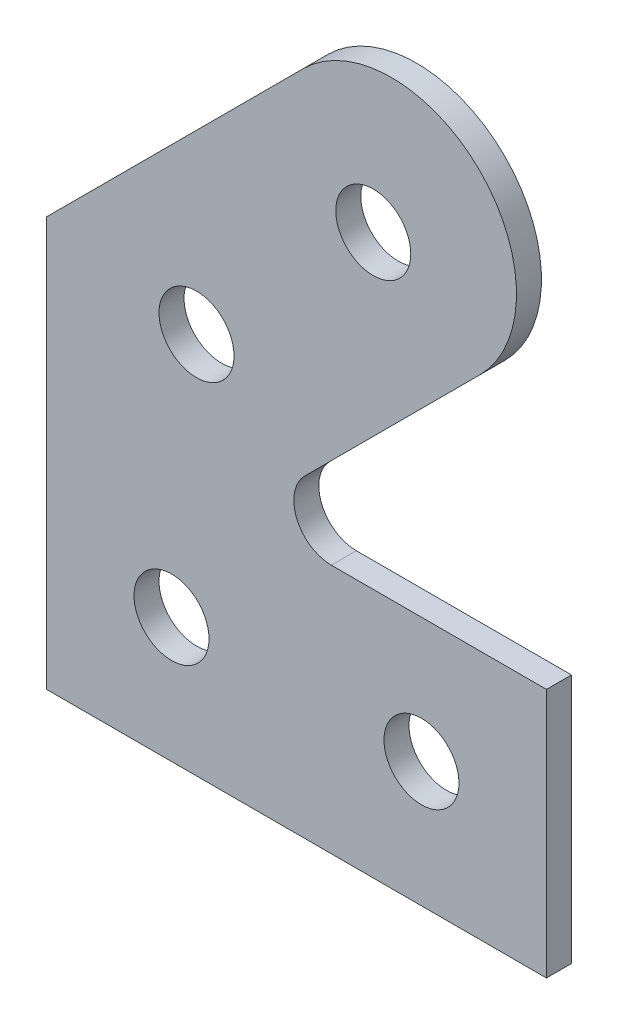
ISO-10303-21;
HEADER;
FILE_DESCRIPTION(('STEP AP214'),'2;1');
FILE_NAME('part.step','',(''),(''),'','','');
FILE_SCHEMA(('AUTOMOTIVE_DESIGN { 1 0 10303 214 1 1 1 1 }'));
ENDSEC;
DATA;
#1=APPLICATION_CONTEXT('core data for automotive mechanical design processes');
#2=APPLICATION_PROTOCOL_DEFINITION('international standard','automotive_design',2000,#1);
#3=PRODUCT_CONTEXT('',#1,'mechanical');
#4=PRODUCT('Part','Part','',(#3));
#5=PRODUCT_RELATED_PRODUCT_CATEGORY('part','',(#4));
#6=PRODUCT_DEFINITION_FORMATION('','',#4);
#7=PRODUCT_DEFINITION_CONTEXT('part definition',#1,'design');
#8=PRODUCT_DEFINITION('design','',#6,#7);
#9=PRODUCT_DEFINITION_SHAPE('','',#8);
#10=(LENGTH_UNIT() NAMED_UNIT(*) SI_UNIT(.MILLI.,.METRE.));
#11=(NAMED_UNIT(*) PLANE_ANGLE_UNIT() SI_UNIT($,.RADIAN.));
#12=(NAMED_UNIT(*) SI_UNIT($,.STERADIAN.) SOLID_ANGLE_UNIT());
#13=UNCERTAINTY_MEASURE_WITH_UNIT(LENGTH_MEASURE(1.E-05),#10,'distance_accuracy_value','');
#14=(GEOMETRIC_REPRESENTATION_CONTEXT(3) GLOBAL_UNCERTAINTY_ASSIGNED_CONTEXT((#13)) GLOBAL_UNIT_ASSIGNED_CONTEXT((#10,
#11,#12)) REPRESENTATION_CONTEXT('',''));
#15=CARTESIAN_POINT('',(0.,0.,0.));
#16=DIRECTION('',(0.,0.,1.));
#17=DIRECTION('',(1.,0.,0.));
#18=AXIS2_PLACEMENT_3D('',#15,#16,#17);
#19=CARTESIAN_POINT('',(13.8,23.1,1.));
#20=DIRECTION('',(0.,0.,-1.));
#21=DIRECTION('',(-1.,0.,0.));
#22=AXIS2_PLACEMENT_3D('',#19,#20,#21);
#23=PLANE('',#22);
#24=DIRECTION('',(0.,-1.,0.));
#25=VECTOR('',#24,1.);
#26=CARTESIAN_POINT('',(0.,0.,1.));
#27=LINE('',#26,#25);
#28=CARTESIAN_POINT('',(0.,16.3710678118655,1.));
#29=VERTEX_POINT('',#28);
#30=CARTESIAN_POINT('',(0.,0.,1.));
#31=VERTEX_POINT('',#30);
#32=EDGE_CURVE('E145',#29,#31,#27,.T.);
#33=ORIENTED_EDGE('',*,*,#32,.T.);
#34=DIRECTION('',(1.,0.,0.));
#35=VECTOR('',#34,1.);
#36=CARTESIAN_POINT('',(0.,0.,1.));
#37=LINE('',#36,#35);
#38=CARTESIAN_POINT('',(20.,0.,1.));
#39=VERTEX_POINT('',#38);
#40=EDGE_CURVE('E93',#31,#39,#37,.T.);
#41=ORIENTED_EDGE('',*,*,#40,.T.);
#42=DIRECTION('',(0.,1.,0.));
#43=VECTOR('',#42,1.);
#44=CARTESIAN_POINT('',(20.,0.,1.));
#45=LINE('',#44,#43);
#46=CARTESIAN_POINT('',(20.,10.,1.));
#47=VERTEX_POINT('',#46);
#48=EDGE_CURVE('E160',#39,#47,#45,.T.);
#49=ORIENTED_EDGE('',*,*,#48,.T.);
#50=DIRECTION('',(-1.,0.,0.));
#51=VECTOR('',#50,1.);
#52=CARTESIAN_POINT('',(20.,10.,1.));
#53=LINE('',#52,#51);
#54=CARTESIAN_POINT('',(11.3923881554251,10.,1.));
#55=VERTEX_POINT('',#54);
#56=EDGE_CURVE('E173',#47,#55,#53,.T.);
#57=ORIENTED_EDGE('',*,*,#56,.T.);
#58=CARTESIAN_POINT('',(11.3923881554251,11.5,1.));
#59=DIRECTION('',(0.,0.,-1.));
#60=DIRECTION('',(-1.,0.,0.));
#61=AXIS2_PLACEMENT_3D('',#58,#59,#60);
#62=CIRCLE('',#61,1.5);
#63=CARTESIAN_POINT('',(10.3317279836453,12.5606601717798,1.));
#64=VERTEX_POINT('',#63);
#65=EDGE_CURVE('E112',#55,#64,#62,.T.);
#66=ORIENTED_EDGE('',*,*,#65,.T.);
#67=DIRECTION('',(0.707106781186549,0.707106781186546,0.));
#68=VECTOR('',#67,1.);
#69=CARTESIAN_POINT('',(10.3317279836453,12.5606601717798,1.));
#70=LINE('',#69,#68);
#71=CARTESIAN_POINT('',(17.3355339059327,19.5644660940673,1.));
#72=VERTEX_POINT('',#71);
#73=EDGE_CURVE('E106',#64,#72,#70,.T.);
#74=ORIENTED_EDGE('',*,*,#73,.T.);
#75=CARTESIAN_POINT('',(13.8,23.1,1.));
#76=DIRECTION('',(0.,0.,1.));
#77=DIRECTION('',(-1.,0.,0.));
#78=AXIS2_PLACEMENT_3D('',#75,#76,#77);
#79=CIRCLE('',#78,5.);
#80=CARTESIAN_POINT('',(10.2644660940673,26.6355339059327,1.));
#81=VERTEX_POINT('',#80);
#82=EDGE_CURVE('E110',#72,#81,#79,.T.);
#83=ORIENTED_EDGE('',*,*,#82,.T.);
#84=DIRECTION('',(-0.707106781186549,-0.707106781186546,0.));
#85=VECTOR('',#84,1.);
#86=CARTESIAN_POINT('',(0.,16.3710678118655,1.));
#87=LINE('',#86,#85);
#88=EDGE_CURVE('E50',#81,#29,#87,.T.);
#89=ORIENTED_EDGE('',*,*,#88,.T.);
#90=EDGE_LOOP('',(#33,#41,#49,#57,#66,#74,#83,#89));
#91=FACE_BOUND('',#90,.T.);
#92=CARTESIAN_POINT('',(5.,5.,1.));
#93=DIRECTION('',(0.,0.,1.));
#94=DIRECTION('',(1.,0.,0.));
#95=AXIS2_PLACEMENT_3D('',#92,#93,#94);
#96=CIRCLE('',#95,1.5);
#97=CARTESIAN_POINT('',(6.5,5.,1.));
#98=VERTEX_POINT('',#97);
#99=EDGE_CURVE('E134',#98,#98,#96,.T.);
#100=ORIENTED_EDGE('',*,*,#99,.F.);
#101=EDGE_LOOP('',(#100));
#102=FACE_BOUND('',#101,.T.);
#103=CARTESIAN_POINT('',(15.,5.,1.));
#104=DIRECTION('',(0.,0.,1.));
#105=DIRECTION('',(1.,0.,0.));
#106=AXIS2_PLACEMENT_3D('',#103,#104,#105);
#107=CIRCLE('',#106,1.5);
#108=CARTESIAN_POINT('',(16.5,5.,1.));
#109=VERTEX_POINT('',#108);
#110=EDGE_CURVE('E182',#109,#109,#107,.T.);
#111=ORIENTED_EDGE('',*,*,#110,.F.);
#112=EDGE_LOOP('',(#111));
#113=FACE_BOUND('',#112,.T.);
#114=CARTESIAN_POINT('',(6.,15.3,1.));
#115=DIRECTION('',(0.,0.,1.));
#116=DIRECTION('',(1.,0.,0.));
#117=AXIS2_PLACEMENT_3D('',#114,#115,#116);
#118=CIRCLE('',#117,1.50000000000003);
#119=CARTESIAN_POINT('',(7.50000000000003,15.3,1.));
#120=VERTEX_POINT('',#119);
#121=EDGE_CURVE('E188',#120,#120,#118,.T.);
#122=ORIENTED_EDGE('',*,*,#121,.F.);
#123=EDGE_LOOP('',(#122));
#124=FACE_BOUND('',#123,.T.);
#125=CARTESIAN_POINT('',(13.0710678118655,22.3710678118655,1.));
#126=DIRECTION('',(0.,0.,1.));
#127=DIRECTION('',(1.,0.,0.));
#128=AXIS2_PLACEMENT_3D('',#125,#126,#127);
#129=CIRCLE('',#128,1.5);
#130=CARTESIAN_POINT('',(14.5710678118655,22.3710678118655,1.));
#131=VERTEX_POINT('',#130);
#132=EDGE_CURVE('E194',#131,#131,#129,.T.);
#133=ORIENTED_EDGE('',*,*,#132,.F.);
#134=EDGE_LOOP('',(#133));
#135=FACE_BOUND('',#134,.T.);
#136=ADVANCED_FACE('F33',(#91,#102,#113,#124,#135),#23,.F.);
#137=CARTESIAN_POINT('',(13.8,23.1,0.));
#138=DIRECTION('',(0.,0.,-1.));
#139=DIRECTION('',(-1.,0.,0.));
#140=AXIS2_PLACEMENT_3D('',#137,#138,#139);
#141=PLANE('',#140);
#142=CARTESIAN_POINT('',(6.,15.3,0.));
#143=DIRECTION('',(0.,0.,1.));
#144=DIRECTION('',(1.,0.,0.));
#145=AXIS2_PLACEMENT_3D('',#142,#143,#144);
#146=CIRCLE('',#145,1.50000000000003);
#147=CARTESIAN_POINT('',(7.50000000000003,15.3,0.));
#148=VERTEX_POINT('',#147);
#149=EDGE_CURVE('E191',#148,#148,#146,.T.);
#150=ORIENTED_EDGE('',*,*,#149,.T.);
#151=EDGE_LOOP('',(#150));
#152=FACE_BOUND('',#151,.T.);
#153=CARTESIAN_POINT('',(5.,5.,0.));
#154=DIRECTION('',(0.,0.,1.));
#155=DIRECTION('',(1.,0.,0.));
#156=AXIS2_PLACEMENT_3D('',#153,#154,#155);
#157=CIRCLE('',#156,1.5);
#158=CARTESIAN_POINT('',(6.5,5.,0.));
#159=VERTEX_POINT('',#158);
#160=EDGE_CURVE('E179',#159,#159,#157,.T.);
#161=ORIENTED_EDGE('',*,*,#160,.T.);
#162=EDGE_LOOP('',(#161));
#163=FACE_BOUND('',#162,.T.);
#164=DIRECTION('',(0.,-1.,0.));
#165=VECTOR('',#164,1.);
#166=CARTESIAN_POINT('',(0.,0.,0.));
#167=LINE('',#166,#165);
#168=CARTESIAN_POINT('',(0.,16.3710678118655,0.));
#169=VERTEX_POINT('',#168);
#170=CARTESIAN_POINT('',(0.,0.,0.));
#171=VERTEX_POINT('',#170);
#172=EDGE_CURVE('E130',#169,#171,#167,.T.);
#173=ORIENTED_EDGE('',*,*,#172,.F.);
#174=DIRECTION('',(-0.707106781186549,-0.707106781186546,0.));
#175=VECTOR('',#174,1.);
#176=CARTESIAN_POINT('',(0.,16.3710678118655,0.));
#177=LINE('',#176,#175);
#178=CARTESIAN_POINT('',(10.2644660940673,26.6355339059327,0.));
#179=VERTEX_POINT('',#178);
#180=EDGE_CURVE('E85',#179,#169,#177,.T.);
#181=ORIENTED_EDGE('',*,*,#180,.F.);
#182=CARTESIAN_POINT('',(13.8,23.1,0.));
#183=DIRECTION('',(0.,0.,1.));
#184=DIRECTION('',(-1.,0.,0.));
#185=AXIS2_PLACEMENT_3D('',#182,#183,#184);
#186=CIRCLE('',#185,5.);
#187=CARTESIAN_POINT('',(17.3355339059327,19.5644660940673,0.));
#188=VERTEX_POINT('',#187);
#189=EDGE_CURVE('E79',#188,#179,#186,.T.);
#190=ORIENTED_EDGE('',*,*,#189,.F.);
#191=DIRECTION('',(0.707106781186549,0.707106781186546,0.));
#192=VECTOR('',#191,1.);
#193=CARTESIAN_POINT('',(10.3317279836453,12.5606601717798,0.));
#194=LINE('',#193,#192);
#195=CARTESIAN_POINT('',(10.3317279836453,12.5606601717798,0.));
#196=VERTEX_POINT('',#195);
#197=EDGE_CURVE('E120',#196,#188,#194,.T.);
#198=ORIENTED_EDGE('',*,*,#197,.F.);
#199=CARTESIAN_POINT('',(11.3923881554251,11.5,0.));
#200=DIRECTION('',(0.,0.,-1.));
#201=DIRECTION('',(-1.,0.,0.));
#202=AXIS2_PLACEMENT_3D('',#199,#200,#201);
#203=CIRCLE('',#202,1.5);
#204=CARTESIAN_POINT('',(11.3923881554251,10.,0.));
#205=VERTEX_POINT('',#204);
#206=EDGE_CURVE('E140',#205,#196,#203,.T.);
#207=ORIENTED_EDGE('',*,*,#206,.F.);
#208=DIRECTION('',(-1.,0.,0.));
#209=VECTOR('',#208,1.);
#210=CARTESIAN_POINT('',(20.,10.,0.));
#211=LINE('',#210,#209);
#212=CARTESIAN_POINT('',(20.,10.,0.));
#213=VERTEX_POINT('',#212);
#214=EDGE_CURVE('E138',#213,#205,#211,.T.);
#215=ORIENTED_EDGE('',*,*,#214,.F.);
#216=DIRECTION('',(0.,1.,0.));
#217=VECTOR('',#216,1.);
#218=CARTESIAN_POINT('',(20.,0.,0.));
#219=LINE('',#218,#217);
#220=CARTESIAN_POINT('',(20.,0.,0.));
#221=VERTEX_POINT('',#220);
#222=EDGE_CURVE('E136',#221,#213,#219,.T.);
#223=ORIENTED_EDGE('',*,*,#222,.F.);
#224=DIRECTION('',(1.,0.,0.));
#225=VECTOR('',#224,1.);
#226=CARTESIAN_POINT('',(0.,0.,0.));
#227=LINE('',#226,#225);
#228=EDGE_CURVE('E133',#171,#221,#227,.T.);
#229=ORIENTED_EDGE('',*,*,#228,.F.);
#230=EDGE_LOOP('',(#173,#181,#190,#198,#207,#215,#223,#229));
#231=FACE_BOUND('',#230,.T.);
#232=CARTESIAN_POINT('',(15.,5.,0.));
#233=DIRECTION('',(0.,0.,1.));
#234=DIRECTION('',(1.,0.,0.));
#235=AXIS2_PLACEMENT_3D('',#232,#233,#234);
#236=CIRCLE('',#235,1.5);
#237=CARTESIAN_POINT('',(16.5,5.,0.));
#238=VERTEX_POINT('',#237);
#239=EDGE_CURVE('E185',#238,#238,#236,.T.);
#240=ORIENTED_EDGE('',*,*,#239,.T.);
#241=EDGE_LOOP('',(#240));
#242=FACE_BOUND('',#241,.T.);
#243=CARTESIAN_POINT('',(13.0710678118655,22.3710678118655,0.));
#244=DIRECTION('',(0.,0.,1.));
#245=DIRECTION('',(1.,0.,0.));
#246=AXIS2_PLACEMENT_3D('',#243,#244,#245);
#247=CIRCLE('',#246,1.5);
#248=CARTESIAN_POINT('',(14.5710678118655,22.3710678118655,0.));
#249=VERTEX_POINT('',#248);
#250=EDGE_CURVE('E197',#249,#249,#247,.T.);
#251=ORIENTED_EDGE('',*,*,#250,.T.);
#252=EDGE_LOOP('',(#251));
#253=FACE_BOUND('',#252,.T.);
#254=ADVANCED_FACE('F164',(#152,#163,#231,#242,#253),#141,.T.);
#255=CARTESIAN_POINT('',(0.,0.,1.));
#256=DIRECTION('',(1.,0.,0.));
#257=DIRECTION('',(0.,0.,-1.));
#258=AXIS2_PLACEMENT_3D('',#255,#256,#257);
#259=PLANE('',#258);
#260=ORIENTED_EDGE('',*,*,#172,.T.);
#261=DIRECTION('',(0.,0.,-1.));
#262=VECTOR('',#261,1.);
#263=CARTESIAN_POINT('',(0.,0.,1.));
#264=LINE('',#263,#262);
#265=EDGE_CURVE('E11',#31,#171,#264,.T.);
#266=ORIENTED_EDGE('',*,*,#265,.F.);
#267=ORIENTED_EDGE('',*,*,#32,.F.);
#268=DIRECTION('',(0.,0.,-1.));
#269=VECTOR('',#268,1.);
#270=CARTESIAN_POINT('',(0.,16.3710678118655,1.));
#271=LINE('',#270,#269);
#272=EDGE_CURVE('E126',#29,#169,#271,.T.);
#273=ORIENTED_EDGE('',*,*,#272,.T.);
#274=EDGE_LOOP('',(#260,#266,#267,#273));
#275=FACE_BOUND('',#274,.T.);
#276=ADVANCED_FACE('F35',(#275),#259,.F.);
#277=CARTESIAN_POINT('',(0.,0.,1.));
#278=DIRECTION('',(0.,1.,0.));
#279=DIRECTION('',(0.,0.,1.));
#280=AXIS2_PLACEMENT_3D('',#277,#278,#279);
#281=PLANE('',#280);
#282=ORIENTED_EDGE('',*,*,#228,.T.);
#283=DIRECTION('',(0.,0.,-1.));
#284=VECTOR('',#283,1.);
#285=CARTESIAN_POINT('',(20.,0.,1.));
#286=LINE('',#285,#284);
#287=EDGE_CURVE('E42',#39,#221,#286,.T.);
#288=ORIENTED_EDGE('',*,*,#287,.F.);
#289=ORIENTED_EDGE('',*,*,#40,.F.);
#290=ORIENTED_EDGE('',*,*,#265,.T.);
#291=EDGE_LOOP('',(#282,#288,#289,#290));
#292=FACE_BOUND('',#291,.T.);
#293=ADVANCED_FACE('F229',(#292),#281,.F.);
#294=CARTESIAN_POINT('',(20.,0.,1.));
#295=DIRECTION('',(-1.,0.,0.));
#296=DIRECTION('',(0.,0.,1.));
#297=AXIS2_PLACEMENT_3D('',#294,#295,#296);
#298=PLANE('',#297);
#299=ORIENTED_EDGE('',*,*,#222,.T.);
#300=DIRECTION('',(0.,0.,-1.));
#301=VECTOR('',#300,1.);
#302=CARTESIAN_POINT('',(20.,10.,1.));
#303=LINE('',#302,#301);
#304=EDGE_CURVE('E152',#47,#213,#303,.T.);
#305=ORIENTED_EDGE('',*,*,#304,.F.);
#306=ORIENTED_EDGE('',*,*,#48,.F.);
#307=ORIENTED_EDGE('',*,*,#287,.T.);
#308=EDGE_LOOP('',(#299,#305,#306,#307));
#309=FACE_BOUND('',#308,.T.);
#310=ADVANCED_FACE('F158',(#309),#298,.F.);
#311=CARTESIAN_POINT('',(20.,10.,1.));
#312=DIRECTION('',(0.,-1.,0.));
#313=DIRECTION('',(1.,0.,0.));
#314=AXIS2_PLACEMENT_3D('',#311,#312,#313);
#315=PLANE('',#314);
#316=ORIENTED_EDGE('',*,*,#214,.T.);
#317=DIRECTION('',(0.,0.,-1.));
#318=VECTOR('',#317,1.);
#319=CARTESIAN_POINT('',(11.3923881554251,10.,1.));
#320=LINE('',#319,#318);
#321=EDGE_CURVE('E149',#55,#205,#320,.T.);
#322=ORIENTED_EDGE('',*,*,#321,.F.);
#323=ORIENTED_EDGE('',*,*,#56,.F.);
#324=ORIENTED_EDGE('',*,*,#304,.T.);
#325=EDGE_LOOP('',(#316,#322,#323,#324));
#326=FACE_BOUND('',#325,.T.);
#327=ADVANCED_FACE('F169',(#326),#315,.F.);
#328=CARTESIAN_POINT('',(11.3923881554251,11.5,1.));
#329=DIRECTION('',(0.,0.,-1.));
#330=DIRECTION('',(-1.,0.,0.));
#331=AXIS2_PLACEMENT_3D('',#328,#329,#330);
#332=CYLINDRICAL_SURFACE('',#331,1.5);
#333=ORIENTED_EDGE('',*,*,#206,.T.);
#334=DIRECTION('',(0.,0.,-1.));
#335=VECTOR('',#334,1.);
#336=CARTESIAN_POINT('',(10.3317279836453,12.5606601717798,1.));
#337=LINE('',#336,#335);
#338=EDGE_CURVE('E121',#64,#196,#337,.T.);
#339=ORIENTED_EDGE('',*,*,#338,.F.);
#340=ORIENTED_EDGE('',*,*,#65,.F.);
#341=ORIENTED_EDGE('',*,*,#321,.T.);
#342=EDGE_LOOP('',(#333,#339,#340,#341));
#343=FACE_BOUND('',#342,.T.);
#344=ADVANCED_FACE('F172',(#343),#332,.F.);
#345=CARTESIAN_POINT('',(10.3317279836453,12.5606601717798,1.));
#346=DIRECTION('',(-0.707106781186546,0.707106781186549,0.));
#347=DIRECTION('',(-0.707106781186549,-0.707106781186546,0.));
#348=AXIS2_PLACEMENT_3D('',#345,#346,#347);
#349=PLANE('',#348);
#350=ORIENTED_EDGE('',*,*,#197,.T.);
#351=DIRECTION('',(0.,0.,-1.));
#352=VECTOR('',#351,1.);
#353=CARTESIAN_POINT('',(17.3355339059327,19.5644660940673,1.));
#354=LINE('',#353,#352);
#355=EDGE_CURVE('E117',#72,#188,#354,.T.);
#356=ORIENTED_EDGE('',*,*,#355,.F.);
#357=ORIENTED_EDGE('',*,*,#73,.F.);
#358=ORIENTED_EDGE('',*,*,#338,.T.);
#359=EDGE_LOOP('',(#350,#356,#357,#358));
#360=FACE_BOUND('',#359,.T.);
#361=ADVANCED_FACE('F118',(#360),#349,.F.);
#362=CARTESIAN_POINT('',(13.8,23.1,1.));
#363=DIRECTION('',(0.,0.,-1.));
#364=DIRECTION('',(-1.,0.,0.));
#365=AXIS2_PLACEMENT_3D('',#362,#363,#364);
#366=CYLINDRICAL_SURFACE('',#365,5.);
#367=ORIENTED_EDGE('',*,*,#189,.T.);
#368=DIRECTION('',(0.,0.,-1.));
#369=VECTOR('',#368,1.);
#370=CARTESIAN_POINT('',(10.2644660940673,26.6355339059327,1.));
#371=LINE('',#370,#369);
#372=EDGE_CURVE('E122',#81,#179,#371,.T.);
#373=ORIENTED_EDGE('',*,*,#372,.F.);
#374=ORIENTED_EDGE('',*,*,#82,.F.);
#375=ORIENTED_EDGE('',*,*,#355,.T.);
#376=EDGE_LOOP('',(#367,#373,#374,#375));
#377=FACE_BOUND('',#376,.T.);
#378=ADVANCED_FACE('F124',(#377),#366,.T.);
#379=CARTESIAN_POINT('',(0.,16.3710678118655,1.));
#380=DIRECTION('',(0.707106781186546,-0.707106781186549,0.));
#381=DIRECTION('',(0.707106781186549,0.707106781186546,0.));
#382=AXIS2_PLACEMENT_3D('',#379,#380,#381);
#383=PLANE('',#382);
#384=ORIENTED_EDGE('',*,*,#180,.T.);
#385=ORIENTED_EDGE('',*,*,#272,.F.);
#386=ORIENTED_EDGE('',*,*,#88,.F.);
#387=ORIENTED_EDGE('',*,*,#372,.T.);
#388=EDGE_LOOP('',(#384,#385,#386,#387));
#389=FACE_BOUND('',#388,.T.);
#390=ADVANCED_FACE('F217',(#389),#383,.F.);
#391=CARTESIAN_POINT('',(5.,5.,1.));
#392=DIRECTION('',(0.,0.,-1.));
#393=DIRECTION('',(-1.,0.,0.));
#394=AXIS2_PLACEMENT_3D('',#391,#392,#393);
#395=CYLINDRICAL_SURFACE('',#394,1.5);
#396=ORIENTED_EDGE('',*,*,#99,.T.);
#397=EDGE_LOOP('',(#396));
#398=FACE_BOUND('',#397,.T.);
#399=ORIENTED_EDGE('',*,*,#160,.F.);
#400=EDGE_LOOP('',(#399));
#401=FACE_BOUND('',#400,.T.);
#402=ADVANCED_FACE('F214',(#398,#401),#395,.F.);
#403=CARTESIAN_POINT('',(15.,5.,1.));
#404=DIRECTION('',(0.,0.,-1.));
#405=DIRECTION('',(-1.,0.,0.));
#406=AXIS2_PLACEMENT_3D('',#403,#404,#405);
#407=CYLINDRICAL_SURFACE('',#406,1.5);
#408=ORIENTED_EDGE('',*,*,#110,.T.);
#409=EDGE_LOOP('',(#408));
#410=FACE_BOUND('',#409,.T.);
#411=ORIENTED_EDGE('',*,*,#239,.F.);
#412=EDGE_LOOP('',(#411));
#413=FACE_BOUND('',#412,.T.);
#414=ADVANCED_FACE('F293',(#410,#413),#407,.F.);
#415=CARTESIAN_POINT('',(6.,15.3,1.));
#416=DIRECTION('',(0.,0.,-1.));
#417=DIRECTION('',(-1.,0.,0.));
#418=AXIS2_PLACEMENT_3D('',#415,#416,#417);
#419=CYLINDRICAL_SURFACE('',#418,1.50000000000003);
#420=ORIENTED_EDGE('',*,*,#121,.T.);
#421=EDGE_LOOP('',(#420));
#422=FACE_BOUND('',#421,.T.);
#423=ORIENTED_EDGE('',*,*,#149,.F.);
#424=EDGE_LOOP('',(#423));
#425=FACE_BOUND('',#424,.T.);
#426=ADVANCED_FACE('F301',(#422,#425),#419,.F.);
#427=CARTESIAN_POINT('',(13.0710678118655,22.3710678118655,1.));
#428=DIRECTION('',(0.,0.,-1.));
#429=DIRECTION('',(-1.,0.,0.));
#430=AXIS2_PLACEMENT_3D('',#427,#428,#429);
#431=CYLINDRICAL_SURFACE('',#430,1.5);
#432=ORIENTED_EDGE('',*,*,#132,.T.);
#433=EDGE_LOOP('',(#432));
#434=FACE_BOUND('',#433,.T.);
#435=ORIENTED_EDGE('',*,*,#250,.F.);
#436=EDGE_LOOP('',(#435));
#437=FACE_BOUND('',#436,.T.);
#438=ADVANCED_FACE('F203',(#434,#437),#431,.F.);
#439=CLOSED_SHELL('',(#136,#254,#276,#293,#310,#327,#344,#361,#378,#390,#402,#414,#426,#438));
#440=MANIFOLD_SOLID_BREP('B2',#439);
#441=ADVANCED_BREP_SHAPE_REPRESENTATION('',(#18,#440),#14);
#442=SHAPE_DEFINITION_REPRESENTATION(#9,#441);
ENDSEC;
END-ISO-10303-21;
